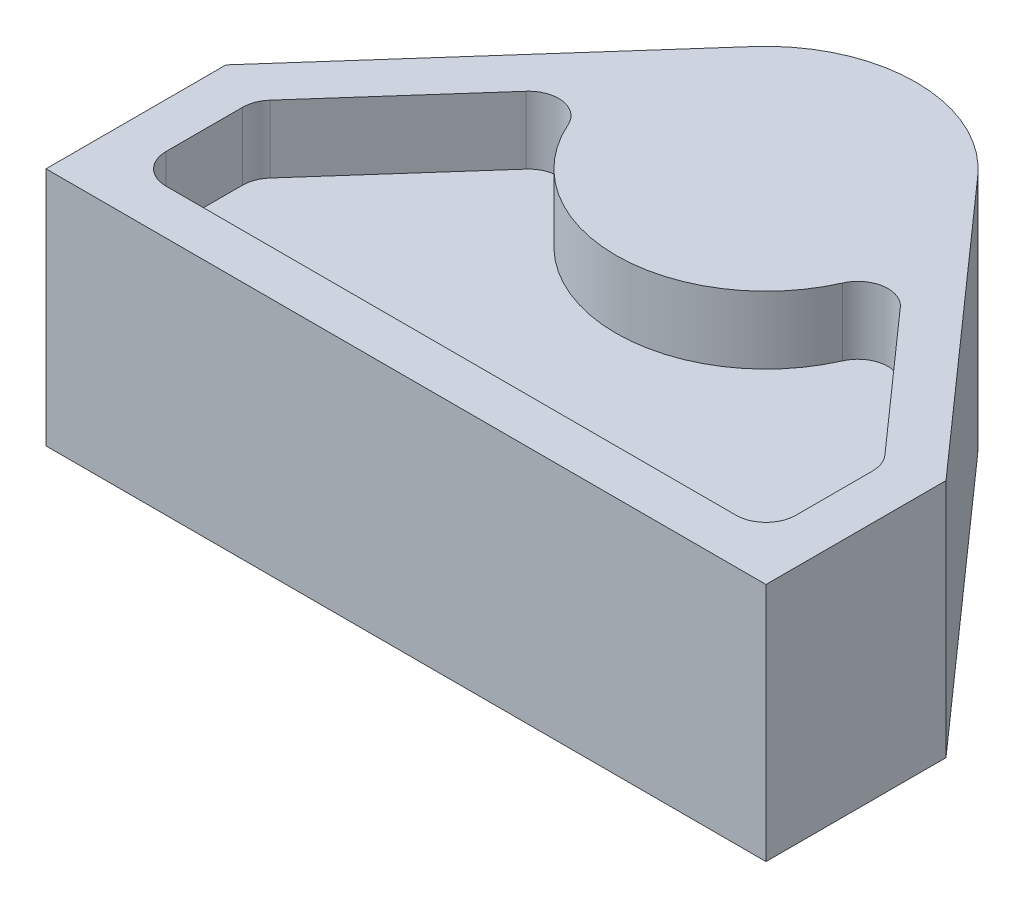
ISO-10303-21;
HEADER;
FILE_DESCRIPTION(('STEP AP214'),'2;1');
FILE_NAME('part.step','',(''),(''),'','','');
FILE_SCHEMA(('AUTOMOTIVE_DESIGN { 1 0 10303 214 1 1 1 1 }'));
ENDSEC;
DATA;
#1=APPLICATION_CONTEXT('core data for automotive mechanical design processes');
#2=APPLICATION_PROTOCOL_DEFINITION('international standard','automotive_design',2000,#1);
#3=PRODUCT_CONTEXT('',#1,'mechanical');
#4=PRODUCT('Part','Part','',(#3));
#5=PRODUCT_RELATED_PRODUCT_CATEGORY('part','',(#4));
#6=PRODUCT_DEFINITION_FORMATION('','',#4);
#7=PRODUCT_DEFINITION_CONTEXT('part definition',#1,'design');
#8=PRODUCT_DEFINITION('design','',#6,#7);
#9=PRODUCT_DEFINITION_SHAPE('','',#8);
#10=(LENGTH_UNIT() NAMED_UNIT(*) SI_UNIT(.MILLI.,.METRE.));
#11=(NAMED_UNIT(*) PLANE_ANGLE_UNIT() SI_UNIT($,.RADIAN.));
#12=(NAMED_UNIT(*) SI_UNIT($,.STERADIAN.) SOLID_ANGLE_UNIT());
#13=UNCERTAINTY_MEASURE_WITH_UNIT(LENGTH_MEASURE(1.E-05),#10,'distance_accuracy_value','');
#14=(GEOMETRIC_REPRESENTATION_CONTEXT(3) GLOBAL_UNCERTAINTY_ASSIGNED_CONTEXT((#13)) GLOBAL_UNIT_ASSIGNED_CONTEXT((#10,
#11,#12)) REPRESENTATION_CONTEXT('',''));
#15=CARTESIAN_POINT('',(0.,0.,0.));
#16=DIRECTION('',(0.,0.,1.));
#17=DIRECTION('',(1.,0.,0.));
#18=AXIS2_PLACEMENT_3D('',#15,#16,#17);
#19=CARTESIAN_POINT('',(38.1,25.4,-9.525));
#20=DIRECTION('',(-1.,0.,0.));
#21=DIRECTION('',(0.,0.,1.));
#22=AXIS2_PLACEMENT_3D('',#19,#20,#21);
#23=PLANE('',#22);
#24=DIRECTION('',(0.,0.,-1.));
#25=VECTOR('',#24,1.);
#26=CARTESIAN_POINT('',(38.1,0.,-9.525));
#27=LINE('',#26,#25);
#28=CARTESIAN_POINT('',(38.1,0.,9.525));
#29=VERTEX_POINT('',#28);
#30=CARTESIAN_POINT('',(38.1,0.,-9.525));
#31=VERTEX_POINT('',#30);
#32=EDGE_CURVE('E88',#29,#31,#27,.T.);
#33=ORIENTED_EDGE('',*,*,#32,.T.);
#34=DIRECTION('',(0.,-1.,0.));
#35=VECTOR('',#34,1.);
#36=CARTESIAN_POINT('',(38.1,25.4,-9.525));
#37=LINE('',#36,#35);
#38=CARTESIAN_POINT('',(38.1,25.4,-9.525));
#39=VERTEX_POINT('',#38);
#40=EDGE_CURVE('E11',#39,#31,#37,.T.);
#41=ORIENTED_EDGE('',*,*,#40,.F.);
#42=DIRECTION('',(0.,0.,-1.));
#43=VECTOR('',#42,1.);
#44=CARTESIAN_POINT('',(38.1,25.4,-9.525));
#45=LINE('',#44,#43);
#46=CARTESIAN_POINT('',(38.1,25.4,9.525));
#47=VERTEX_POINT('',#46);
#48=EDGE_CURVE('E81',#47,#39,#45,.T.);
#49=ORIENTED_EDGE('',*,*,#48,.F.);
#50=DIRECTION('',(0.,-1.,0.));
#51=VECTOR('',#50,1.);
#52=CARTESIAN_POINT('',(38.1,25.4,9.525));
#53=LINE('',#52,#51);
#54=EDGE_CURVE('E74',#47,#29,#53,.T.);
#55=ORIENTED_EDGE('',*,*,#54,.T.);
#56=EDGE_LOOP('',(#33,#41,#49,#55));
#57=FACE_BOUND('',#56,.T.);
#58=ADVANCED_FACE('F32',(#57),#23,.F.);
#59=CARTESIAN_POINT('',(-38.1,25.4,-9.525));
#60=DIRECTION('',(1.,0.,0.));
#61=DIRECTION('',(0.,0.,-1.));
#62=AXIS2_PLACEMENT_3D('',#59,#60,#61);
#63=PLANE('',#62);
#64=DIRECTION('',(0.,0.,1.));
#65=VECTOR('',#64,1.);
#66=CARTESIAN_POINT('',(-38.1,0.,-9.525));
#67=LINE('',#66,#65);
#68=CARTESIAN_POINT('',(-38.1,0.,-9.525));
#69=VERTEX_POINT('',#68);
#70=CARTESIAN_POINT('',(-38.1,0.,9.525));
#71=VERTEX_POINT('',#70);
#72=EDGE_CURVE('E82',#69,#71,#67,.T.);
#73=ORIENTED_EDGE('',*,*,#72,.T.);
#74=DIRECTION('',(0.,-1.,0.));
#75=VECTOR('',#74,1.);
#76=CARTESIAN_POINT('',(-38.1,25.4,9.525));
#77=LINE('',#76,#75);
#78=CARTESIAN_POINT('',(-38.1,25.4,9.525));
#79=VERTEX_POINT('',#78);
#80=EDGE_CURVE('E77',#79,#71,#77,.T.);
#81=ORIENTED_EDGE('',*,*,#80,.F.);
#82=DIRECTION('',(0.,0.,1.));
#83=VECTOR('',#82,1.);
#84=CARTESIAN_POINT('',(-38.1,25.4,-9.525));
#85=LINE('',#84,#83);
#86=CARTESIAN_POINT('',(-38.1,25.4,-9.525));
#87=VERTEX_POINT('',#86);
#88=EDGE_CURVE('E109',#87,#79,#85,.T.);
#89=ORIENTED_EDGE('',*,*,#88,.F.);
#90=DIRECTION('',(0.,-1.,0.));
#91=VECTOR('',#90,1.);
#92=CARTESIAN_POINT('',(-38.1,25.4,-9.525));
#93=LINE('',#92,#91);
#94=EDGE_CURVE('E39',#87,#69,#93,.T.);
#95=ORIENTED_EDGE('',*,*,#94,.T.);
#96=EDGE_LOOP('',(#73,#81,#89,#95));
#97=FACE_BOUND('',#96,.T.);
#98=ADVANCED_FACE('F108',(#97),#63,.F.);
#99=CARTESIAN_POINT('',(-38.1,25.4,9.525));
#100=DIRECTION('',(0.,0.,-1.));
#101=DIRECTION('',(-1.,0.,0.));
#102=AXIS2_PLACEMENT_3D('',#99,#100,#101);
#103=PLANE('',#102);
#104=DIRECTION('',(1.,0.,0.));
#105=VECTOR('',#104,1.);
#106=CARTESIAN_POINT('',(-38.1,0.,9.525));
#107=LINE('',#106,#105);
#108=EDGE_CURVE('E71',#71,#29,#107,.T.);
#109=ORIENTED_EDGE('',*,*,#108,.T.);
#110=ORIENTED_EDGE('',*,*,#54,.F.);
#111=DIRECTION('',(1.,0.,0.));
#112=VECTOR('',#111,1.);
#113=CARTESIAN_POINT('',(-38.1,25.4,9.525));
#114=LINE('',#113,#112);
#115=EDGE_CURVE('E55',#79,#47,#114,.T.);
#116=ORIENTED_EDGE('',*,*,#115,.F.);
#117=ORIENTED_EDGE('',*,*,#80,.T.);
#118=EDGE_LOOP('',(#109,#110,#116,#117));
#119=FACE_BOUND('',#118,.T.);
#120=ADVANCED_FACE('F73',(#119),#103,.F.);
#121=CARTESIAN_POINT('',(0.,25.4,0.));
#122=DIRECTION('',(0.,1.,0.));
#123=DIRECTION('',(0.,0.,1.));
#124=AXIS2_PLACEMENT_3D('',#121,#122,#123);
#125=PLANE('',#124);
#126=CARTESIAN_POINT('',(-30.1625,25.4,-6.51346599652732));
#127=DIRECTION('',(0.,1.,0.));
#128=DIRECTION('',(0.,0.,-1.));
#129=AXIS2_PLACEMENT_3D('',#126,#127,#128);
#130=CIRCLE('',#129,3.175);
#131=CARTESIAN_POINT('',(-32.5384477074538,25.4,-8.61952807810161));
#132=VERTEX_POINT('',#131);
#133=CARTESIAN_POINT('',(-33.3375,25.4,-6.5134659965273));
#134=VERTEX_POINT('',#133);
#135=EDGE_CURVE('E46',#132,#134,#130,.T.);
#136=ORIENTED_EDGE('',*,*,#135,.F.);
#137=DIRECTION('',(-0.663326639865915,0.,0.748329986599624));
#138=VECTOR('',#137,1.);
#139=CARTESIAN_POINT('',(-19.8030294478105,25.4,-22.9869525154888));
#140=LINE('',#139,#138);
#141=CARTESIAN_POINT('',(-19.8030294478105,25.4,-22.9869525154888));
#142=VERTEX_POINT('',#141);
#143=EDGE_CURVE('E152',#142,#132,#140,.T.);
#144=ORIENTED_EDGE('',*,*,#143,.F.);
#145=CARTESIAN_POINT('',(-17.4270817403567,25.4,-20.8808904339145));
#146=DIRECTION('',(0.,1.,0.));
#147=DIRECTION('',(0.,0.,-1.));
#148=AXIS2_PLACEMENT_3D('',#145,#146,#147);
#149=CIRCLE('',#148,3.175);
#150=CARTESIAN_POINT('',(-14.5225681169639,25.4,-22.1632420282621));
#151=VERTEX_POINT('',#150);
#152=EDGE_CURVE('E225',#151,#142,#149,.T.);
#153=ORIENTED_EDGE('',*,*,#152,.F.);
#154=CARTESIAN_POINT('',(0.,25.4,-28.575));
#155=DIRECTION('',(0.,-1.,0.));
#156=DIRECTION('',(0.,0.,1.));
#157=AXIS2_PLACEMENT_3D('',#154,#155,#156);
#158=CIRCLE('',#157,15.875);
#159=CARTESIAN_POINT('',(14.5225681169639,25.4,-22.1632420282621));
#160=VERTEX_POINT('',#159);
#161=EDGE_CURVE('E223',#160,#151,#158,.T.);
#162=ORIENTED_EDGE('',*,*,#161,.F.);
#163=CARTESIAN_POINT('',(17.4270817403567,25.4,-20.8808904339146));
#164=DIRECTION('',(0.,1.,0.));
#165=DIRECTION('',(0.,0.,-1.));
#166=AXIS2_PLACEMENT_3D('',#163,#164,#165);
#167=CIRCLE('',#166,3.175);
#168=CARTESIAN_POINT('',(19.8030294478105,25.4,-22.9869525154888));
#169=VERTEX_POINT('',#168);
#170=EDGE_CURVE('E220',#169,#160,#167,.T.);
#171=ORIENTED_EDGE('',*,*,#170,.F.);
#172=DIRECTION('',(-0.663326639865915,0.,-0.748329986599625));
#173=VECTOR('',#172,1.);
#174=CARTESIAN_POINT('',(32.5384477074538,25.4,-8.61952807810162));
#175=LINE('',#174,#173);
#176=CARTESIAN_POINT('',(32.5384477074538,25.4,-8.61952807810162));
#177=VERTEX_POINT('',#176);
#178=EDGE_CURVE('E217',#177,#169,#175,.T.);
#179=ORIENTED_EDGE('',*,*,#178,.F.);
#180=CARTESIAN_POINT('',(30.1625,25.4,-6.51346599652733));
#181=DIRECTION('',(0.,1.,0.));
#182=DIRECTION('',(0.,0.,1.));
#183=AXIS2_PLACEMENT_3D('',#180,#181,#182);
#184=CIRCLE('',#183,3.175);
#185=CARTESIAN_POINT('',(33.3375,25.4,-6.51346599652731));
#186=VERTEX_POINT('',#185);
#187=EDGE_CURVE('E214',#186,#177,#184,.T.);
#188=ORIENTED_EDGE('',*,*,#187,.F.);
#189=DIRECTION('',(0.,0.,-1.));
#190=VECTOR('',#189,1.);
#191=CARTESIAN_POINT('',(33.3375,25.4,1.58749999999998));
#192=LINE('',#191,#190);
#193=CARTESIAN_POINT('',(33.3375,25.4,1.58749999999998));
#194=VERTEX_POINT('',#193);
#195=EDGE_CURVE('E211',#194,#186,#192,.T.);
#196=ORIENTED_EDGE('',*,*,#195,.F.);
#197=CARTESIAN_POINT('',(30.1625,25.4,1.5875));
#198=DIRECTION('',(0.,1.,0.));
#199=DIRECTION('',(0.,0.,1.));
#200=AXIS2_PLACEMENT_3D('',#197,#198,#199);
#201=CIRCLE('',#200,3.175);
#202=CARTESIAN_POINT('',(30.1625,25.4,4.7625));
#203=VERTEX_POINT('',#202);
#204=EDGE_CURVE('E208',#203,#194,#201,.T.);
#205=ORIENTED_EDGE('',*,*,#204,.F.);
#206=DIRECTION('',(1.,0.,0.));
#207=VECTOR('',#206,1.);
#208=CARTESIAN_POINT('',(-30.1625,25.4,4.7625));
#209=LINE('',#208,#207);
#210=CARTESIAN_POINT('',(-30.1625,25.4,4.7625));
#211=VERTEX_POINT('',#210);
#212=EDGE_CURVE('E205',#211,#203,#209,.T.);
#213=ORIENTED_EDGE('',*,*,#212,.F.);
#214=CARTESIAN_POINT('',(-30.1625,25.4,1.5875));
#215=DIRECTION('',(0.,1.,0.));
#216=DIRECTION('',(0.,0.,-1.));
#217=AXIS2_PLACEMENT_3D('',#214,#215,#216);
#218=CIRCLE('',#217,3.175);
#219=CARTESIAN_POINT('',(-33.3375,25.4,1.58749999999998));
#220=VERTEX_POINT('',#219);
#221=EDGE_CURVE('E202',#220,#211,#218,.T.);
#222=ORIENTED_EDGE('',*,*,#221,.F.);
#223=DIRECTION('',(0.,0.,1.));
#224=VECTOR('',#223,1.);
#225=CARTESIAN_POINT('',(-33.3375,25.4,-6.5134659965273));
#226=LINE('',#225,#224);
#227=EDGE_CURVE('E200',#134,#220,#226,.T.);
#228=ORIENTED_EDGE('',*,*,#227,.F.);
#229=EDGE_LOOP('',(#136,#144,#153,#162,#171,#179,#188,#196,#205,#213,#222,#228));
#230=FACE_BOUND('',#229,.T.);
#231=ORIENTED_EDGE('',*,*,#48,.T.);
#232=DIRECTION('',(-0.663326639865915,0.,-0.748329986599624));
#233=VECTOR('',#232,1.);
#234=CARTESIAN_POINT('',(38.1,25.4,-9.525));
#235=LINE('',#234,#233);
#236=CARTESIAN_POINT('',(11.8797385372691,25.4,-39.1053104078714));
#237=VERTEX_POINT('',#236);
#238=EDGE_CURVE('E120',#39,#237,#235,.T.);
#239=ORIENTED_EDGE('',*,*,#238,.T.);
#240=CARTESIAN_POINT('',(0.,25.4,-28.575));
#241=DIRECTION('',(0.,1.,0.));
#242=DIRECTION('',(0.,0.,1.));
#243=AXIS2_PLACEMENT_3D('',#240,#241,#242);
#244=CIRCLE('',#243,15.875);
#245=CARTESIAN_POINT('',(-11.879738537269,25.4,-39.1053104078714));
#246=VERTEX_POINT('',#245);
#247=EDGE_CURVE('E123',#237,#246,#244,.T.);
#248=ORIENTED_EDGE('',*,*,#247,.T.);
#249=DIRECTION('',(-0.663326639865916,0.,0.748329986599624));
#250=VECTOR('',#249,1.);
#251=CARTESIAN_POINT('',(-38.1,25.4,-9.525));
#252=LINE('',#251,#250);
#253=EDGE_CURVE('E128',#246,#87,#252,.T.);
#254=ORIENTED_EDGE('',*,*,#253,.T.);
#255=ORIENTED_EDGE('',*,*,#88,.T.);
#256=ORIENTED_EDGE('',*,*,#115,.T.);
#257=EDGE_LOOP('',(#231,#239,#248,#254,#255,#256));
#258=FACE_BOUND('',#257,.T.);
#259=ADVANCED_FACE('F131',(#230,#258),#125,.T.);
#260=CARTESIAN_POINT('',(0.,0.,0.));
#261=DIRECTION('',(0.,1.,0.));
#262=DIRECTION('',(0.,0.,1.));
#263=AXIS2_PLACEMENT_3D('',#260,#261,#262);
#264=PLANE('',#263);
#265=ORIENTED_EDGE('',*,*,#32,.F.);
#266=ORIENTED_EDGE('',*,*,#108,.F.);
#267=ORIENTED_EDGE('',*,*,#72,.F.);
#268=DIRECTION('',(-0.663326639865916,0.,0.748329986599624));
#269=VECTOR('',#268,1.);
#270=CARTESIAN_POINT('',(-38.1,0.,-9.525));
#271=LINE('',#270,#269);
#272=CARTESIAN_POINT('',(-11.879738537269,0.,-39.1053104078714));
#273=VERTEX_POINT('',#272);
#274=EDGE_CURVE('E114',#273,#69,#271,.T.);
#275=ORIENTED_EDGE('',*,*,#274,.F.);
#276=CARTESIAN_POINT('',(0.,0.,-28.575));
#277=DIRECTION('',(0.,1.,0.));
#278=DIRECTION('',(0.,0.,1.));
#279=AXIS2_PLACEMENT_3D('',#276,#277,#278);
#280=CIRCLE('',#279,15.875);
#281=CARTESIAN_POINT('',(11.8797385372691,0.,-39.1053104078714));
#282=VERTEX_POINT('',#281);
#283=EDGE_CURVE('E117',#282,#273,#280,.T.);
#284=ORIENTED_EDGE('',*,*,#283,.F.);
#285=DIRECTION('',(-0.663326639865915,0.,-0.748329986599624));
#286=VECTOR('',#285,1.);
#287=CARTESIAN_POINT('',(38.1,0.,-9.525));
#288=LINE('',#287,#286);
#289=EDGE_CURVE('E94',#31,#282,#288,.T.);
#290=ORIENTED_EDGE('',*,*,#289,.F.);
#291=EDGE_LOOP('',(#265,#266,#267,#275,#284,#290));
#292=FACE_BOUND('',#291,.T.);
#293=ADVANCED_FACE('F91',(#292),#264,.F.);
#294=CARTESIAN_POINT('',(38.1,25.4,-9.525));
#295=DIRECTION('',(-0.748329986599625,0.,0.663326639865915));
#296=DIRECTION('',(0.663326639865915,0.,0.748329986599625));
#297=AXIS2_PLACEMENT_3D('',#294,#295,#296);
#298=PLANE('',#297);
#299=ORIENTED_EDGE('',*,*,#289,.T.);
#300=DIRECTION('',(0.,-1.,0.));
#301=VECTOR('',#300,1.);
#302=CARTESIAN_POINT('',(11.8797385372691,25.4,-39.1053104078714));
#303=LINE('',#302,#301);
#304=EDGE_CURVE('E95',#237,#282,#303,.T.);
#305=ORIENTED_EDGE('',*,*,#304,.F.);
#306=ORIENTED_EDGE('',*,*,#238,.F.);
#307=ORIENTED_EDGE('',*,*,#40,.T.);
#308=EDGE_LOOP('',(#299,#305,#306,#307));
#309=FACE_BOUND('',#308,.T.);
#310=ADVANCED_FACE('F309',(#309),#298,.F.);
#311=CARTESIAN_POINT('',(0.,25.4,-28.575));
#312=DIRECTION('',(0.,-1.,0.));
#313=DIRECTION('',(0.,0.,-1.));
#314=AXIS2_PLACEMENT_3D('',#311,#312,#313);
#315=CYLINDRICAL_SURFACE('',#314,15.875);
#316=ORIENTED_EDGE('',*,*,#283,.T.);
#317=DIRECTION('',(0.,-1.,0.));
#318=VECTOR('',#317,1.);
#319=CARTESIAN_POINT('',(-11.879738537269,25.4,-39.1053104078714));
#320=LINE('',#319,#318);
#321=EDGE_CURVE('E99',#246,#273,#320,.T.);
#322=ORIENTED_EDGE('',*,*,#321,.F.);
#323=ORIENTED_EDGE('',*,*,#247,.F.);
#324=ORIENTED_EDGE('',*,*,#304,.T.);
#325=EDGE_LOOP('',(#316,#322,#323,#324));
#326=FACE_BOUND('',#325,.T.);
#327=ADVANCED_FACE('F311',(#326),#315,.T.);
#328=CARTESIAN_POINT('',(-38.1,25.4,-9.525));
#329=DIRECTION('',(0.748329986599624,0.,0.663326639865916));
#330=DIRECTION('',(0.663326639865916,0.,-0.748329986599624));
#331=AXIS2_PLACEMENT_3D('',#328,#329,#330);
#332=PLANE('',#331);
#333=ORIENTED_EDGE('',*,*,#274,.T.);
#334=ORIENTED_EDGE('',*,*,#94,.F.);
#335=ORIENTED_EDGE('',*,*,#253,.F.);
#336=ORIENTED_EDGE('',*,*,#321,.T.);
#337=EDGE_LOOP('',(#333,#334,#335,#336));
#338=FACE_BOUND('',#337,.T.);
#339=ADVANCED_FACE('F312',(#338),#332,.F.);
#340=CARTESIAN_POINT('',(-30.1625,18.2626,-6.51346599652732));
#341=DIRECTION('',(0.,1.,0.));
#342=DIRECTION('',(0.,0.,1.));
#343=AXIS2_PLACEMENT_3D('',#340,#341,#342);
#344=CYLINDRICAL_SURFACE('',#343,3.175);
#345=ORIENTED_EDGE('',*,*,#135,.T.);
#346=DIRECTION('',(0.,1.,0.));
#347=VECTOR('',#346,1.);
#348=CARTESIAN_POINT('',(-33.3375,18.2626,-6.5134659965273));
#349=LINE('',#348,#347);
#350=CARTESIAN_POINT('',(-33.3375,18.2626,-6.5134659965273));
#351=VERTEX_POINT('',#350);
#352=EDGE_CURVE('E181',#351,#134,#349,.T.);
#353=ORIENTED_EDGE('',*,*,#352,.F.);
#354=CARTESIAN_POINT('',(-30.1625,18.2626,-6.51346599652732));
#355=DIRECTION('',(0.,1.,0.));
#356=DIRECTION('',(0.,0.,-1.));
#357=AXIS2_PLACEMENT_3D('',#354,#355,#356);
#358=CIRCLE('',#357,3.175);
#359=CARTESIAN_POINT('',(-32.5384477074538,18.2626,-8.61952807810161));
#360=VERTEX_POINT('',#359);
#361=EDGE_CURVE('E232',#360,#351,#358,.T.);
#362=ORIENTED_EDGE('',*,*,#361,.F.);
#363=DIRECTION('',(0.,1.,0.));
#364=VECTOR('',#363,1.);
#365=CARTESIAN_POINT('',(-32.5384477074538,18.2626,-8.61952807810161));
#366=LINE('',#365,#364);
#367=EDGE_CURVE('E139',#360,#132,#366,.T.);
#368=ORIENTED_EDGE('',*,*,#367,.T.);
#369=EDGE_LOOP('',(#345,#353,#362,#368));
#370=FACE_BOUND('',#369,.T.);
#371=ADVANCED_FACE('F314',(#370),#344,.F.);
#372=CARTESIAN_POINT('',(-19.8030294478105,18.2626,-22.9869525154888));
#373=DIRECTION('',(-0.748329986599625,0.,-0.663326639865915));
#374=DIRECTION('',(-0.663326639865915,0.,0.748329986599625));
#375=AXIS2_PLACEMENT_3D('',#372,#373,#374);
#376=PLANE('',#375);
#377=ORIENTED_EDGE('',*,*,#143,.T.);
#378=ORIENTED_EDGE('',*,*,#367,.F.);
#379=DIRECTION('',(-0.663326639865915,0.,0.748329986599624));
#380=VECTOR('',#379,1.);
#381=CARTESIAN_POINT('',(-19.8030294478105,18.2626,-22.9869525154888));
#382=LINE('',#381,#380);
#383=CARTESIAN_POINT('',(-19.8030294478105,18.2626,-22.9869525154888));
#384=VERTEX_POINT('',#383);
#385=EDGE_CURVE('E182',#384,#360,#382,.T.);
#386=ORIENTED_EDGE('',*,*,#385,.F.);
#387=DIRECTION('',(0.,1.,0.));
#388=VECTOR('',#387,1.);
#389=CARTESIAN_POINT('',(-19.8030294478105,18.2626,-22.9869525154888));
#390=LINE('',#389,#388);
#391=EDGE_CURVE('E142',#384,#142,#390,.T.);
#392=ORIENTED_EDGE('',*,*,#391,.T.);
#393=EDGE_LOOP('',(#377,#378,#386,#392));
#394=FACE_BOUND('',#393,.T.);
#395=ADVANCED_FACE('F320',(#394),#376,.F.);
#396=CARTESIAN_POINT('',(-17.4270817403567,18.2626,-20.8808904339145));
#397=DIRECTION('',(0.,1.,0.));
#398=DIRECTION('',(0.,0.,1.));
#399=AXIS2_PLACEMENT_3D('',#396,#397,#398);
#400=CYLINDRICAL_SURFACE('',#399,3.175);
#401=ORIENTED_EDGE('',*,*,#152,.T.);
#402=ORIENTED_EDGE('',*,*,#391,.F.);
#403=CARTESIAN_POINT('',(-17.4270817403567,18.2626,-20.8808904339145));
#404=DIRECTION('',(0.,1.,0.));
#405=DIRECTION('',(0.,0.,-1.));
#406=AXIS2_PLACEMENT_3D('',#403,#404,#405);
#407=CIRCLE('',#406,3.175);
#408=CARTESIAN_POINT('',(-14.5225681169639,18.2626,-22.1632420282621));
#409=VERTEX_POINT('',#408);
#410=EDGE_CURVE('E188',#409,#384,#407,.T.);
#411=ORIENTED_EDGE('',*,*,#410,.F.);
#412=DIRECTION('',(0.,1.,0.));
#413=VECTOR('',#412,1.);
#414=CARTESIAN_POINT('',(-14.5225681169639,18.2626,-22.1632420282621));
#415=LINE('',#414,#413);
#416=EDGE_CURVE('E149',#409,#151,#415,.T.);
#417=ORIENTED_EDGE('',*,*,#416,.T.);
#418=EDGE_LOOP('',(#401,#402,#411,#417));
#419=FACE_BOUND('',#418,.T.);
#420=ADVANCED_FACE('F374',(#419),#400,.F.);
#421=CARTESIAN_POINT('',(0.,18.2626,-28.575));
#422=DIRECTION('',(0.,1.,0.));
#423=DIRECTION('',(0.,0.,1.));
#424=AXIS2_PLACEMENT_3D('',#421,#422,#423);
#425=CYLINDRICAL_SURFACE('',#424,15.875);
#426=ORIENTED_EDGE('',*,*,#161,.T.);
#427=ORIENTED_EDGE('',*,*,#416,.F.);
#428=CARTESIAN_POINT('',(0.,18.2626,-28.575));
#429=DIRECTION('',(0.,-1.,0.));
#430=DIRECTION('',(0.,0.,1.));
#431=AXIS2_PLACEMENT_3D('',#428,#429,#430);
#432=CIRCLE('',#431,15.875);
#433=CARTESIAN_POINT('',(14.5225681169639,18.2626,-22.1632420282621));
#434=VERTEX_POINT('',#433);
#435=EDGE_CURVE('E195',#434,#409,#432,.T.);
#436=ORIENTED_EDGE('',*,*,#435,.F.);
#437=DIRECTION('',(0.,1.,0.));
#438=VECTOR('',#437,1.);
#439=CARTESIAN_POINT('',(14.5225681169639,18.2626,-22.1632420282621));
#440=LINE('',#439,#438);
#441=EDGE_CURVE('E157',#434,#160,#440,.T.);
#442=ORIENTED_EDGE('',*,*,#441,.T.);
#443=EDGE_LOOP('',(#426,#427,#436,#442));
#444=FACE_BOUND('',#443,.T.);
#445=ADVANCED_FACE('F271',(#444),#425,.T.);
#446=CARTESIAN_POINT('',(17.4270817403567,18.2626,-20.8808904339146));
#447=DIRECTION('',(0.,1.,0.));
#448=DIRECTION('',(0.,0.,1.));
#449=AXIS2_PLACEMENT_3D('',#446,#447,#448);
#450=CYLINDRICAL_SURFACE('',#449,3.175);
#451=ORIENTED_EDGE('',*,*,#170,.T.);
#452=ORIENTED_EDGE('',*,*,#441,.F.);
#453=CARTESIAN_POINT('',(17.4270817403567,18.2626,-20.8808904339146));
#454=DIRECTION('',(0.,1.,0.));
#455=DIRECTION('',(0.,0.,-1.));
#456=AXIS2_PLACEMENT_3D('',#453,#454,#455);
#457=CIRCLE('',#456,3.175);
#458=CARTESIAN_POINT('',(19.8030294478105,18.2626,-22.9869525154888));
#459=VERTEX_POINT('',#458);
#460=EDGE_CURVE('E258',#459,#434,#457,.T.);
#461=ORIENTED_EDGE('',*,*,#460,.F.);
#462=DIRECTION('',(0.,1.,0.));
#463=VECTOR('',#462,1.);
#464=CARTESIAN_POINT('',(19.8030294478105,18.2626,-22.9869525154888));
#465=LINE('',#464,#463);
#466=EDGE_CURVE('E160',#459,#169,#465,.T.);
#467=ORIENTED_EDGE('',*,*,#466,.T.);
#468=EDGE_LOOP('',(#451,#452,#461,#467));
#469=FACE_BOUND('',#468,.T.);
#470=ADVANCED_FACE('F391',(#469),#450,.F.);
#471=CARTESIAN_POINT('',(32.5384477074538,18.2626,-8.61952807810162));
#472=DIRECTION('',(0.748329986599625,0.,-0.663326639865915));
#473=DIRECTION('',(-0.663326639865915,0.,-0.748329986599625));
#474=AXIS2_PLACEMENT_3D('',#471,#472,#473);
#475=PLANE('',#474);
#476=ORIENTED_EDGE('',*,*,#178,.T.);
#477=ORIENTED_EDGE('',*,*,#466,.F.);
#478=DIRECTION('',(-0.663326639865915,0.,-0.748329986599625));
#479=VECTOR('',#478,1.);
#480=CARTESIAN_POINT('',(32.5384477074538,18.2626,-8.61952807810162));
#481=LINE('',#480,#479);
#482=CARTESIAN_POINT('',(32.5384477074538,18.2626,-8.61952807810162));
#483=VERTEX_POINT('',#482);
#484=EDGE_CURVE('E255',#483,#459,#481,.T.);
#485=ORIENTED_EDGE('',*,*,#484,.F.);
#486=DIRECTION('',(0.,1.,0.));
#487=VECTOR('',#486,1.);
#488=CARTESIAN_POINT('',(32.5384477074538,18.2626,-8.61952807810162));
#489=LINE('',#488,#487);
#490=EDGE_CURVE('E163',#483,#177,#489,.T.);
#491=ORIENTED_EDGE('',*,*,#490,.T.);
#492=EDGE_LOOP('',(#476,#477,#485,#491));
#493=FACE_BOUND('',#492,.T.);
#494=ADVANCED_FACE('F400',(#493),#475,.F.);
#495=CARTESIAN_POINT('',(30.1625,18.2626,-6.51346599652733));
#496=DIRECTION('',(0.,1.,0.));
#497=DIRECTION('',(0.,0.,1.));
#498=AXIS2_PLACEMENT_3D('',#495,#496,#497);
#499=CYLINDRICAL_SURFACE('',#498,3.175);
#500=ORIENTED_EDGE('',*,*,#187,.T.);
#501=ORIENTED_EDGE('',*,*,#490,.F.);
#502=CARTESIAN_POINT('',(30.1625,18.2626,-6.51346599652733));
#503=DIRECTION('',(0.,1.,0.));
#504=DIRECTION('',(0.,0.,1.));
#505=AXIS2_PLACEMENT_3D('',#502,#503,#504);
#506=CIRCLE('',#505,3.175);
#507=CARTESIAN_POINT('',(33.3375,18.2626,-6.51346599652731));
#508=VERTEX_POINT('',#507);
#509=EDGE_CURVE('E252',#508,#483,#506,.T.);
#510=ORIENTED_EDGE('',*,*,#509,.F.);
#511=DIRECTION('',(0.,1.,0.));
#512=VECTOR('',#511,1.);
#513=CARTESIAN_POINT('',(33.3375,18.2626,-6.51346599652731));
#514=LINE('',#513,#512);
#515=EDGE_CURVE('E166',#508,#186,#514,.T.);
#516=ORIENTED_EDGE('',*,*,#515,.T.);
#517=EDGE_LOOP('',(#500,#501,#510,#516));
#518=FACE_BOUND('',#517,.T.);
#519=ADVANCED_FACE('F409',(#518),#499,.F.);
#520=CARTESIAN_POINT('',(33.3375,18.2626,1.58749999999998));
#521=DIRECTION('',(1.,0.,0.));
#522=DIRECTION('',(0.,0.,-1.));
#523=AXIS2_PLACEMENT_3D('',#520,#521,#522);
#524=PLANE('',#523);
#525=ORIENTED_EDGE('',*,*,#195,.T.);
#526=ORIENTED_EDGE('',*,*,#515,.F.);
#527=DIRECTION('',(0.,0.,-1.));
#528=VECTOR('',#527,1.);
#529=CARTESIAN_POINT('',(33.3375,18.2626,1.58749999999998));
#530=LINE('',#529,#528);
#531=CARTESIAN_POINT('',(33.3375,18.2626,1.58749999999998));
#532=VERTEX_POINT('',#531);
#533=EDGE_CURVE('E249',#532,#508,#530,.T.);
#534=ORIENTED_EDGE('',*,*,#533,.F.);
#535=DIRECTION('',(0.,1.,0.));
#536=VECTOR('',#535,1.);
#537=CARTESIAN_POINT('',(33.3375,18.2626,1.58749999999998));
#538=LINE('',#537,#536);
#539=EDGE_CURVE('E169',#532,#194,#538,.T.);
#540=ORIENTED_EDGE('',*,*,#539,.T.);
#541=EDGE_LOOP('',(#525,#526,#534,#540));
#542=FACE_BOUND('',#541,.T.);
#543=ADVANCED_FACE('F419',(#542),#524,.F.);
#544=CARTESIAN_POINT('',(30.1625,18.2626,1.5875));
#545=DIRECTION('',(0.,1.,0.));
#546=DIRECTION('',(0.,0.,1.));
#547=AXIS2_PLACEMENT_3D('',#544,#545,#546);
#548=CYLINDRICAL_SURFACE('',#547,3.175);
#549=ORIENTED_EDGE('',*,*,#204,.T.);
#550=ORIENTED_EDGE('',*,*,#539,.F.);
#551=CARTESIAN_POINT('',(30.1625,18.2626,1.5875));
#552=DIRECTION('',(0.,1.,0.));
#553=DIRECTION('',(0.,0.,1.));
#554=AXIS2_PLACEMENT_3D('',#551,#552,#553);
#555=CIRCLE('',#554,3.175);
#556=CARTESIAN_POINT('',(30.1625,18.2626,4.7625));
#557=VERTEX_POINT('',#556);
#558=EDGE_CURVE('E246',#557,#532,#555,.T.);
#559=ORIENTED_EDGE('',*,*,#558,.F.);
#560=DIRECTION('',(0.,1.,0.));
#561=VECTOR('',#560,1.);
#562=CARTESIAN_POINT('',(30.1625,18.2626,4.7625));
#563=LINE('',#562,#561);
#564=EDGE_CURVE('E172',#557,#203,#563,.T.);
#565=ORIENTED_EDGE('',*,*,#564,.T.);
#566=EDGE_LOOP('',(#549,#550,#559,#565));
#567=FACE_BOUND('',#566,.T.);
#568=ADVANCED_FACE('F429',(#567),#548,.F.);
#569=CARTESIAN_POINT('',(-30.1625,18.2626,4.7625));
#570=DIRECTION('',(0.,0.,1.));
#571=DIRECTION('',(1.,0.,0.));
#572=AXIS2_PLACEMENT_3D('',#569,#570,#571);
#573=PLANE('',#572);
#574=ORIENTED_EDGE('',*,*,#212,.T.);
#575=ORIENTED_EDGE('',*,*,#564,.F.);
#576=DIRECTION('',(1.,0.,0.));
#577=VECTOR('',#576,1.);
#578=CARTESIAN_POINT('',(-30.1625,18.2626,4.7625));
#579=LINE('',#578,#577);
#580=CARTESIAN_POINT('',(-30.1625,18.2626,4.7625));
#581=VERTEX_POINT('',#580);
#582=EDGE_CURVE('E243',#581,#557,#579,.T.);
#583=ORIENTED_EDGE('',*,*,#582,.F.);
#584=DIRECTION('',(0.,1.,0.));
#585=VECTOR('',#584,1.);
#586=CARTESIAN_POINT('',(-30.1625,18.2626,4.7625));
#587=LINE('',#586,#585);
#588=EDGE_CURVE('E175',#581,#211,#587,.T.);
#589=ORIENTED_EDGE('',*,*,#588,.T.);
#590=EDGE_LOOP('',(#574,#575,#583,#589));
#591=FACE_BOUND('',#590,.T.);
#592=ADVANCED_FACE('F439',(#591),#573,.F.);
#593=CARTESIAN_POINT('',(-30.1625,18.2626,1.5875));
#594=DIRECTION('',(0.,1.,0.));
#595=DIRECTION('',(0.,0.,1.));
#596=AXIS2_PLACEMENT_3D('',#593,#594,#595);
#597=CYLINDRICAL_SURFACE('',#596,3.175);
#598=ORIENTED_EDGE('',*,*,#221,.T.);
#599=ORIENTED_EDGE('',*,*,#588,.F.);
#600=CARTESIAN_POINT('',(-30.1625,18.2626,1.5875));
#601=DIRECTION('',(0.,1.,0.));
#602=DIRECTION('',(0.,0.,-1.));
#603=AXIS2_PLACEMENT_3D('',#600,#601,#602);
#604=CIRCLE('',#603,3.175);
#605=CARTESIAN_POINT('',(-33.3375,18.2626,1.58749999999998));
#606=VERTEX_POINT('',#605);
#607=EDGE_CURVE('E238',#606,#581,#604,.T.);
#608=ORIENTED_EDGE('',*,*,#607,.F.);
#609=DIRECTION('',(0.,1.,0.));
#610=VECTOR('',#609,1.);
#611=CARTESIAN_POINT('',(-33.3375,18.2626,1.58749999999998));
#612=LINE('',#611,#610);
#613=EDGE_CURVE('E178',#606,#220,#612,.T.);
#614=ORIENTED_EDGE('',*,*,#613,.T.);
#615=EDGE_LOOP('',(#598,#599,#608,#614));
#616=FACE_BOUND('',#615,.T.);
#617=ADVANCED_FACE('F449',(#616),#597,.F.);
#618=CARTESIAN_POINT('',(-33.3375,18.2626,-6.5134659965273));
#619=DIRECTION('',(-1.,0.,0.));
#620=DIRECTION('',(0.,0.,1.));
#621=AXIS2_PLACEMENT_3D('',#618,#619,#620);
#622=PLANE('',#621);
#623=ORIENTED_EDGE('',*,*,#227,.T.);
#624=ORIENTED_EDGE('',*,*,#613,.F.);
#625=DIRECTION('',(0.,0.,1.));
#626=VECTOR('',#625,1.);
#627=CARTESIAN_POINT('',(-33.3375,18.2626,-6.5134659965273));
#628=LINE('',#627,#626);
#629=EDGE_CURVE('E234',#351,#606,#628,.T.);
#630=ORIENTED_EDGE('',*,*,#629,.F.);
#631=ORIENTED_EDGE('',*,*,#352,.T.);
#632=EDGE_LOOP('',(#623,#624,#630,#631));
#633=FACE_BOUND('',#632,.T.);
#634=ADVANCED_FACE('F459',(#633),#622,.F.);
#635=CARTESIAN_POINT('',(-30.1625,18.2626,-6.51346599652732));
#636=DIRECTION('',(0.,-1.,0.));
#637=DIRECTION('',(0.,0.,-1.));
#638=AXIS2_PLACEMENT_3D('',#635,#636,#637);
#639=PLANE('',#638);
#640=ORIENTED_EDGE('',*,*,#361,.T.);
#641=ORIENTED_EDGE('',*,*,#629,.T.);
#642=ORIENTED_EDGE('',*,*,#607,.T.);
#643=ORIENTED_EDGE('',*,*,#582,.T.);
#644=ORIENTED_EDGE('',*,*,#558,.T.);
#645=ORIENTED_EDGE('',*,*,#533,.T.);
#646=ORIENTED_EDGE('',*,*,#509,.T.);
#647=ORIENTED_EDGE('',*,*,#484,.T.);
#648=ORIENTED_EDGE('',*,*,#460,.T.);
#649=ORIENTED_EDGE('',*,*,#435,.T.);
#650=ORIENTED_EDGE('',*,*,#410,.T.);
#651=ORIENTED_EDGE('',*,*,#385,.T.);
#652=EDGE_LOOP('',(#640,#641,#642,#643,#644,#645,#646,#647,#648,#649,#650,#651));
#653=FACE_BOUND('',#652,.T.);
#654=ADVANCED_FACE('F263',(#653),#639,.F.);
#655=CLOSED_SHELL('',(#58,#98,#120,#259,#293,#310,#327,#339,#371,#395,#420,#445,#470,#494,#519,
#543,#568,#592,#617,#634,#654));
#656=MANIFOLD_SOLID_BREP('B2',#655);
#657=ADVANCED_BREP_SHAPE_REPRESENTATION('',(#18,#656),#14);
#658=SHAPE_DEFINITION_REPRESENTATION(#9,#657);
ENDSEC;
END-ISO-10303-21;
